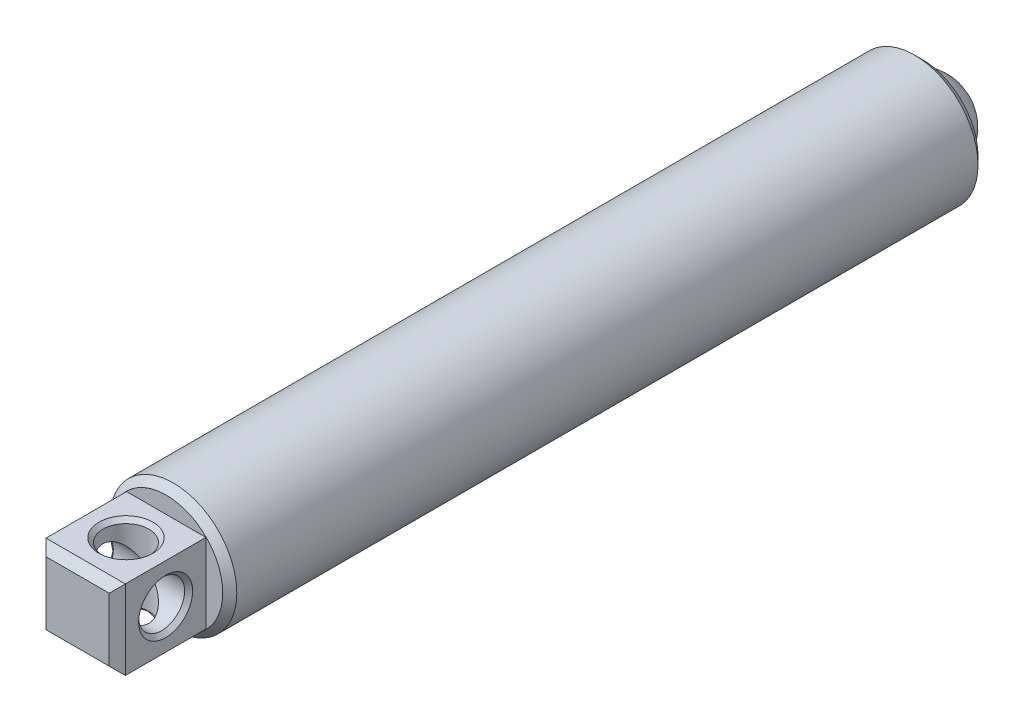
ISO-10303-21;
HEADER;
FILE_DESCRIPTION(('STEP AP214'),'2;1');
FILE_NAME('part.step','',(''),(''),'','','');
FILE_SCHEMA(('AUTOMOTIVE_DESIGN { 1 0 10303 214 1 1 1 1 }'));
ENDSEC;
DATA;
#1=APPLICATION_CONTEXT('core data for automotive mechanical design processes');
#2=APPLICATION_PROTOCOL_DEFINITION('international standard','automotive_design',2000,#1);
#3=PRODUCT_CONTEXT('',#1,'mechanical');
#4=PRODUCT('Part','Part','',(#3));
#5=PRODUCT_RELATED_PRODUCT_CATEGORY('part','',(#4));
#6=PRODUCT_DEFINITION_FORMATION('','',#4);
#7=PRODUCT_DEFINITION_CONTEXT('part definition',#1,'design');
#8=PRODUCT_DEFINITION('design','',#6,#7);
#9=PRODUCT_DEFINITION_SHAPE('','',#8);
#10=(LENGTH_UNIT() NAMED_UNIT(*) SI_UNIT(.MILLI.,.METRE.));
#11=(NAMED_UNIT(*) PLANE_ANGLE_UNIT() SI_UNIT($,.RADIAN.));
#12=(NAMED_UNIT(*) SI_UNIT($,.STERADIAN.) SOLID_ANGLE_UNIT());
#13=UNCERTAINTY_MEASURE_WITH_UNIT(LENGTH_MEASURE(1.E-05),#10,'distance_accuracy_value','');
#14=(GEOMETRIC_REPRESENTATION_CONTEXT(3) GLOBAL_UNCERTAINTY_ASSIGNED_CONTEXT((#13)) GLOBAL_UNIT_ASSIGNED_CONTEXT((#10,
#11,#12)) REPRESENTATION_CONTEXT('',''));
#15=CARTESIAN_POINT('',(0.,0.,0.));
#16=DIRECTION('',(0.,0.,1.));
#17=DIRECTION('',(1.,0.,0.));
#18=AXIS2_PLACEMENT_3D('',#15,#16,#17);
#19=CARTESIAN_POINT('',(-0.337483037474602,-2.46036743646982,8.6550518928985));
#20=DIRECTION('',(1.,0.,0.));
#21=DIRECTION('',(0.,0.,-1.));
#22=AXIS2_PLACEMENT_3D('',#19,#20,#21);
#23=CYLINDRICAL_SURFACE('',#22,0.7239);
#24=CARTESIAN_POINT('',(2.7855129625254,-2.46036743646982,8.6550518928985));
#25=DIRECTION('',(-1.,0.,0.));
#26=DIRECTION('',(0.,0.,1.));
#27=AXIS2_PLACEMENT_3D('',#24,#25,#26);
#28=CIRCLE('',#27,0.7239);
#29=CARTESIAN_POINT('',(2.7855129625254,-2.46036743646982,9.3789518928985));
#30=VERTEX_POINT('',#29);
#31=EDGE_CURVE('P0_E120',#30,#30,#28,.F.);
#32=ORIENTED_EDGE('',*,*,#31,.T.);
#33=EDGE_LOOP('',(#32));
#34=FACE_BOUND('',#33,.T.);
#35=CARTESIAN_POINT('',(1.6625129625254,-2.46036743646982,8.6550518928985));
#36=DIRECTION('',(0.707106781186547,-0.707106781186547,0.));
#37=DIRECTION('',(0.707106781186547,0.707106781186547,0.));
#38=AXIS2_PLACEMENT_3D('',#35,#36,#37);
#39=ELLIPSE('',#38,1.02374919780188,0.7239);
#40=CARTESIAN_POINT('',(1.6625129625254,-2.46036743646982,9.3789518928985));
#41=VERTEX_POINT('',#40);
#42=CARTESIAN_POINT('',(1.6625129625254,-2.46036743646982,7.9311518928985));
#43=VERTEX_POINT('',#42);
#44=EDGE_CURVE('P0_E87',#41,#43,#39,.F.);
#45=ORIENTED_EDGE('',*,*,#44,.T.);
#46=CARTESIAN_POINT('',(1.6625129625254,-2.46036743646982,8.6550518928985));
#47=DIRECTION('',(0.707106781186547,0.707106781186547,0.));
#48=DIRECTION('',(0.707106781186547,-0.707106781186547,0.));
#49=AXIS2_PLACEMENT_3D('',#46,#47,#48);
#50=ELLIPSE('',#49,1.02374919780188,0.7239);
#51=EDGE_CURVE('P0_E83',#43,#41,#50,.F.);
#52=ORIENTED_EDGE('',*,*,#51,.T.);
#53=EDGE_LOOP('',(#45,#52));
#54=FACE_BOUND('',#53,.T.);
#55=ADVANCED_FACE('P0_F16',(#34,#54),#23,.F.);
#56=CARTESIAN_POINT('',(1.6625129625254,-0.682367436469824,7.3850518928985));
#57=DIRECTION('',(0.,0.,-1.));
#58=DIRECTION('',(-1.,0.,0.));
#59=AXIS2_PLACEMENT_3D('',#56,#57,#58);
#60=PLANE('',#59);
#61=CARTESIAN_POINT('',(1.6625129625254,-2.46036743646982,7.3850518928985));
#62=DIRECTION('',(0.,0.,1.));
#63=DIRECTION('',(1.,0.,0.));
#64=AXIS2_PLACEMENT_3D('',#61,#62,#63);
#65=CIRCLE('',#64,1.778);
#66=CARTESIAN_POINT('',(3.4405129625254,-2.46036743646982,7.3850518928985));
#67=VERTEX_POINT('',#66);
#68=EDGE_CURVE('P0_E179',#67,#67,#65,.T.);
#69=ORIENTED_EDGE('',*,*,#68,.T.);
#70=EDGE_LOOP('',(#69));
#71=FACE_BOUND('',#70,.T.);
#72=DIRECTION('',(0.,1.,0.));
#73=VECTOR('',#72,1.);
#74=CARTESIAN_POINT('',(2.9125129625254,-3.71036743646982,7.3850518928985));
#75=LINE('',#74,#73);
#76=CARTESIAN_POINT('',(2.9125129625254,-3.71036743646982,7.3850518928985));
#77=VERTEX_POINT('',#76);
#78=CARTESIAN_POINT('',(2.9125129625254,-1.21036743646982,7.3850518928985));
#79=VERTEX_POINT('',#78);
#80=EDGE_CURVE('P0_E153',#77,#79,#75,.T.);
#81=ORIENTED_EDGE('',*,*,#80,.F.);
#82=DIRECTION('',(1.,0.,0.));
#83=VECTOR('',#82,1.);
#84=CARTESIAN_POINT('',(0.412512962525397,-3.71036743646982,7.3850518928985));
#85=LINE('',#84,#83);
#86=CARTESIAN_POINT('',(0.412512962525397,-3.71036743646982,7.3850518928985));
#87=VERTEX_POINT('',#86);
#88=EDGE_CURVE('P0_E168',#87,#77,#85,.T.);
#89=ORIENTED_EDGE('',*,*,#88,.F.);
#90=DIRECTION('',(0.,-1.,0.));
#91=VECTOR('',#90,1.);
#92=CARTESIAN_POINT('',(0.412512962525397,-3.71036743646982,7.3850518928985));
#93=LINE('',#92,#91);
#94=CARTESIAN_POINT('',(0.412512962525397,-1.21036743646982,7.3850518928985));
#95=VERTEX_POINT('',#94);
#96=EDGE_CURVE('P0_E163',#95,#87,#93,.T.);
#97=ORIENTED_EDGE('',*,*,#96,.F.);
#98=DIRECTION('',(-1.,0.,0.));
#99=VECTOR('',#98,1.);
#100=CARTESIAN_POINT('',(0.412512962525397,-1.21036743646982,7.3850518928985));
#101=LINE('',#100,#99);
#102=EDGE_CURVE('P0_E158',#79,#95,#101,.T.);
#103=ORIENTED_EDGE('',*,*,#102,.F.);
#104=EDGE_LOOP('',(#81,#89,#97,#103));
#105=FACE_BOUND('',#104,.T.);
#106=ADVANCED_FACE('P0_F196',(#71,#105),#60,.F.);
#107=CARTESIAN_POINT('',(1.6625129625254,-2.46036743646982,-14.2614545806176));
#108=DIRECTION('',(0.,0.,-1.));
#109=DIRECTION('',(-1.,0.,0.));
#110=AXIS2_PLACEMENT_3D('',#107,#108,#109);
#111=CONICAL_SURFACE('',#110,0.,0.785398163397443);
#112=CARTESIAN_POINT('',(1.6625129625254,-2.46036743646982,-15.6584545806176));
#113=DIRECTION('',(0.,0.,1.));
#114=DIRECTION('',(1.,0.,0.));
#115=AXIS2_PLACEMENT_3D('',#112,#113,#114);
#116=CIRCLE('',#115,1.397);
#117=CARTESIAN_POINT('',(3.0595129625254,-2.46036743646982,-15.6584545806176));
#118=VERTEX_POINT('',#117);
#119=EDGE_CURVE('P0_E93',#118,#118,#116,.T.);
#120=ORIENTED_EDGE('',*,*,#119,.F.);
#121=EDGE_LOOP('',(#120));
#122=FACE_BOUND('',#121,.T.);
#123=CARTESIAN_POINT('',(1.6625129625254,-2.46036743646982,-14.2614545806176));
#124=VERTEX_POINT('',#123);
#125=VERTEX_LOOP('',#124);
#126=FACE_BOUND('',#125,.T.);
#127=ADVANCED_FACE('P0_F193',(#122,#126),#111,.F.);
#128=CARTESIAN_POINT('',(1.6625129625254,-2.46036743646982,7.3850518928985));
#129=DIRECTION('',(0.,0.,1.));
#130=DIRECTION('',(1.,0.,0.));
#131=AXIS2_PLACEMENT_3D('',#128,#129,#130);
#132=CYLINDRICAL_SURFACE('',#131,1.397);
#133=CARTESIAN_POINT('',(1.6625129625254,-2.46036743646982,-16.4465481071015));
#134=DIRECTION('',(0.,0.,1.));
#135=DIRECTION('',(1.,0.,0.));
#136=AXIS2_PLACEMENT_3D('',#133,#134,#135);
#137=CIRCLE('',#136,1.397);
#138=CARTESIAN_POINT('',(3.0595129625254,-2.46036743646982,-16.4465481071015));
#139=VERTEX_POINT('',#138);
#140=EDGE_CURVE('P0_E185',#139,#139,#137,.T.);
#141=ORIENTED_EDGE('',*,*,#140,.F.);
#142=EDGE_LOOP('',(#141));
#143=FACE_BOUND('',#142,.T.);
#144=ORIENTED_EDGE('',*,*,#119,.T.);
#145=EDGE_LOOP('',(#144));
#146=FACE_BOUND('',#145,.T.);
#147=ADVANCED_FACE('P0_F191',(#143,#146),#132,.F.);
#148=CARTESIAN_POINT('',(1.6625129625254,-0.460371436469824,-16.4465481071015));
#149=DIRECTION('',(0.,0.,1.));
#150=DIRECTION('',(1.,0.,0.));
#151=AXIS2_PLACEMENT_3D('',#148,#149,#150);
#152=PLANE('',#151);
#153=CARTESIAN_POINT('',(1.6625129625254,-2.46036743646982,-16.4465481071015));
#154=DIRECTION('',(0.,0.,1.));
#155=DIRECTION('',(1.,0.,0.));
#156=AXIS2_PLACEMENT_3D('',#153,#154,#155);
#157=CIRCLE('',#156,1.745996);
#158=CARTESIAN_POINT('',(3.4085089625254,-2.46036743646982,-16.4465481071015));
#159=VERTEX_POINT('',#158);
#160=EDGE_CURVE('P0_E102',#159,#159,#157,.F.);
#161=ORIENTED_EDGE('',*,*,#160,.T.);
#162=EDGE_LOOP('',(#161));
#163=FACE_BOUND('',#162,.T.);
#164=ORIENTED_EDGE('',*,*,#140,.T.);
#165=EDGE_LOOP('',(#164));
#166=FACE_BOUND('',#165,.T.);
#167=ADVANCED_FACE('P0_F203',(#163,#166),#152,.F.);
#168=CARTESIAN_POINT('',(1.6625129625254,-2.46036743646982,7.3850518928985));
#169=DIRECTION('',(0.,0.,1.));
#170=DIRECTION('',(1.,0.,0.));
#171=AXIS2_PLACEMENT_3D('',#168,#169,#170);
#172=CYLINDRICAL_SURFACE('',#171,1.999996);
#173=CARTESIAN_POINT('',(1.6625129625254,-2.46036743646982,-16.1925481071015));
#174=DIRECTION('',(0.,0.,1.));
#175=DIRECTION('',(1.,0.,0.));
#176=AXIS2_PLACEMENT_3D('',#173,#174,#175);
#177=CIRCLE('',#176,1.999996);
#178=CARTESIAN_POINT('',(3.6625089625254,-2.46036743646982,-16.1925481071015));
#179=VERTEX_POINT('',#178);
#180=EDGE_CURVE('P0_E95',#179,#179,#177,.T.);
#181=ORIENTED_EDGE('',*,*,#180,.T.);
#182=EDGE_LOOP('',(#181));
#183=FACE_BOUND('',#182,.T.);
#184=CARTESIAN_POINT('',(1.6625129625254,-2.46036743646982,7.1630558928985));
#185=DIRECTION('',(0.,0.,1.));
#186=DIRECTION('',(1.,0.,0.));
#187=AXIS2_PLACEMENT_3D('',#184,#185,#186);
#188=CIRCLE('',#187,1.999996);
#189=CARTESIAN_POINT('',(3.6625089625254,-2.46036743646982,7.1630558928985));
#190=VERTEX_POINT('',#189);
#191=EDGE_CURVE('P0_E182',#190,#190,#188,.T.);
#192=ORIENTED_EDGE('',*,*,#191,.F.);
#193=EDGE_LOOP('',(#192));
#194=FACE_BOUND('',#193,.T.);
#195=ADVANCED_FACE('P0_F286',(#183,#194),#172,.T.);
#196=CARTESIAN_POINT('',(1.6625129625254,-2.46036743646982,7.1630558928985));
#197=DIRECTION('',(0.,0.,-1.));
#198=DIRECTION('',(-1.,0.,0.));
#199=AXIS2_PLACEMENT_3D('',#196,#197,#198);
#200=CONICAL_SURFACE('',#199,1.999996,0.78539816339745);
#201=ORIENTED_EDGE('',*,*,#68,.F.);
#202=EDGE_LOOP('',(#201));
#203=FACE_BOUND('',#202,.T.);
#204=ORIENTED_EDGE('',*,*,#191,.T.);
#205=EDGE_LOOP('',(#204));
#206=FACE_BOUND('',#205,.T.);
#207=ADVANCED_FACE('P0_F289',(#203,#206),#200,.T.);
#208=CARTESIAN_POINT('',(2.9125129625254,-3.71036743646982,10.1790518928985));
#209=DIRECTION('',(-1.,0.,0.));
#210=DIRECTION('',(0.,0.,1.));
#211=AXIS2_PLACEMENT_3D('',#208,#209,#210);
#212=PLANE('',#211);
#213=CARTESIAN_POINT('',(2.9125129625254,-2.46036743646982,8.6550518928985));
#214=DIRECTION('',(-1.,0.,0.));
#215=DIRECTION('',(0.,0.,1.));
#216=AXIS2_PLACEMENT_3D('',#213,#214,#215);
#217=CIRCLE('',#216,0.850900000000001);
#218=CARTESIAN_POINT('',(2.9125129625254,-2.46036743646982,9.5059518928985));
#219=VERTEX_POINT('',#218);
#220=EDGE_CURVE('P0_E117',#219,#219,#217,.T.);
#221=ORIENTED_EDGE('',*,*,#220,.T.);
#222=EDGE_LOOP('',(#221));
#223=FACE_BOUND('',#222,.T.);
#224=DIRECTION('',(0.,0.,-1.));
#225=VECTOR('',#224,1.);
#226=CARTESIAN_POINT('',(2.9125129625254,-1.21036743646982,10.1790518928985));
#227=LINE('',#226,#225);
#228=CARTESIAN_POINT('',(2.9125129625254,-1.21036743646982,9.9250518928985));
#229=VERTEX_POINT('',#228);
#230=EDGE_CURVE('P0_E177',#229,#79,#227,.T.);
#231=ORIENTED_EDGE('',*,*,#230,.F.);
#232=DIRECTION('',(0.,-1.,0.));
#233=VECTOR('',#232,1.);
#234=CARTESIAN_POINT('',(2.9125129625254,-3.71036743646982,9.9250518928985));
#235=LINE('',#234,#233);
#236=CARTESIAN_POINT('',(2.9125129625254,-3.71036743646982,9.9250518928985));
#237=VERTEX_POINT('',#236);
#238=EDGE_CURVE('P0_E11',#229,#237,#235,.T.);
#239=ORIENTED_EDGE('',*,*,#238,.T.);
#240=DIRECTION('',(0.,0.,-1.));
#241=VECTOR('',#240,1.);
#242=CARTESIAN_POINT('',(2.9125129625254,-3.71036743646982,10.1790518928985));
#243=LINE('',#242,#241);
#244=EDGE_CURVE('P0_E171',#237,#77,#243,.T.);
#245=ORIENTED_EDGE('',*,*,#244,.T.);
#246=ORIENTED_EDGE('',*,*,#80,.T.);
#247=EDGE_LOOP('',(#231,#239,#245,#246));
#248=FACE_BOUND('',#247,.T.);
#249=ADVANCED_FACE('P0_F246',(#223,#248),#212,.F.);
#250=CARTESIAN_POINT('',(0.412512962525397,-1.21036743646982,10.1790518928985));
#251=DIRECTION('',(0.,-1.,0.));
#252=DIRECTION('',(0.,0.,-1.));
#253=AXIS2_PLACEMENT_3D('',#250,#251,#252);
#254=PLANE('',#253);
#255=CARTESIAN_POINT('',(1.6625129625254,-1.21036743646982,8.6550518928985));
#256=DIRECTION('',(0.,-1.,0.));
#257=DIRECTION('',(0.,0.,-1.));
#258=AXIS2_PLACEMENT_3D('',#255,#256,#257);
#259=CIRCLE('',#258,0.850900000000002);
#260=CARTESIAN_POINT('',(1.6625129625254,-1.21036743646982,7.8041518928985));
#261=VERTEX_POINT('',#260);
#262=EDGE_CURVE('P0_E123',#261,#261,#259,.T.);
#263=ORIENTED_EDGE('',*,*,#262,.T.);
#264=EDGE_LOOP('',(#263));
#265=FACE_BOUND('',#264,.T.);
#266=DIRECTION('',(0.,0.,-1.));
#267=VECTOR('',#266,1.);
#268=CARTESIAN_POINT('',(0.412512962525397,-1.21036743646982,10.1790518928985));
#269=LINE('',#268,#267);
#270=CARTESIAN_POINT('',(0.412512962525397,-1.21036743646982,9.9250518928985));
#271=VERTEX_POINT('',#270);
#272=EDGE_CURVE('P0_E175',#271,#95,#269,.T.);
#273=ORIENTED_EDGE('',*,*,#272,.F.);
#274=DIRECTION('',(1.,0.,0.));
#275=VECTOR('',#274,1.);
#276=CARTESIAN_POINT('',(0.412512962525397,-1.21036743646982,9.9250518928985));
#277=LINE('',#276,#275);
#278=EDGE_CURVE('P0_E25',#271,#229,#277,.T.);
#279=ORIENTED_EDGE('',*,*,#278,.T.);
#280=ORIENTED_EDGE('',*,*,#230,.T.);
#281=ORIENTED_EDGE('',*,*,#102,.T.);
#282=EDGE_LOOP('',(#273,#279,#280,#281));
#283=FACE_BOUND('',#282,.T.);
#284=ADVANCED_FACE('P0_F237',(#265,#283),#254,.F.);
#285=CARTESIAN_POINT('',(0.412512962525397,-3.71036743646982,10.1790518928985));
#286=DIRECTION('',(1.,0.,0.));
#287=DIRECTION('',(0.,0.,-1.));
#288=AXIS2_PLACEMENT_3D('',#285,#286,#287);
#289=PLANE('',#288);
#290=CARTESIAN_POINT('',(0.412512962525397,-2.46036743646982,8.6550518928985));
#291=DIRECTION('',(1.,0.,0.));
#292=DIRECTION('',(0.,0.,-1.));
#293=AXIS2_PLACEMENT_3D('',#290,#291,#292);
#294=CIRCLE('',#293,0.850900000000001);
#295=CARTESIAN_POINT('',(0.412512962525397,-2.46036743646982,7.8041518928985));
#296=VERTEX_POINT('',#295);
#297=EDGE_CURVE('P0_E105',#296,#296,#294,.T.);
#298=ORIENTED_EDGE('',*,*,#297,.T.);
#299=EDGE_LOOP('',(#298));
#300=FACE_BOUND('',#299,.T.);
#301=DIRECTION('',(0.,0.,-1.));
#302=VECTOR('',#301,1.);
#303=CARTESIAN_POINT('',(0.412512962525397,-3.71036743646982,10.1790518928985));
#304=LINE('',#303,#302);
#305=CARTESIAN_POINT('',(0.412512962525397,-3.71036743646982,9.9250518928985));
#306=VERTEX_POINT('',#305);
#307=EDGE_CURVE('P0_E173',#306,#87,#304,.T.);
#308=ORIENTED_EDGE('',*,*,#307,.F.);
#309=DIRECTION('',(0.,1.,0.));
#310=VECTOR('',#309,1.);
#311=CARTESIAN_POINT('',(0.412512962525397,-3.71036743646982,9.9250518928985));
#312=LINE('',#311,#310);
#313=EDGE_CURVE('P0_E40',#306,#271,#312,.T.);
#314=ORIENTED_EDGE('',*,*,#313,.T.);
#315=ORIENTED_EDGE('',*,*,#272,.T.);
#316=ORIENTED_EDGE('',*,*,#96,.T.);
#317=EDGE_LOOP('',(#308,#314,#315,#316));
#318=FACE_BOUND('',#317,.T.);
#319=ADVANCED_FACE('P0_F235',(#300,#318),#289,.F.);
#320=CARTESIAN_POINT('',(0.412512962525397,-3.71036743646982,10.1790518928985));
#321=DIRECTION('',(0.,1.,0.));
#322=DIRECTION('',(0.,0.,1.));
#323=AXIS2_PLACEMENT_3D('',#320,#321,#322);
#324=PLANE('',#323);
#325=CARTESIAN_POINT('',(1.6625129625254,-3.71036743646982,8.6550518928985));
#326=DIRECTION('',(0.,1.,0.));
#327=DIRECTION('',(0.,0.,1.));
#328=AXIS2_PLACEMENT_3D('',#325,#326,#327);
#329=CIRCLE('',#328,0.850900000000001);
#330=CARTESIAN_POINT('',(1.6625129625254,-3.71036743646982,9.5059518928985));
#331=VERTEX_POINT('',#330);
#332=EDGE_CURVE('P0_E111',#331,#331,#329,.T.);
#333=ORIENTED_EDGE('',*,*,#332,.T.);
#334=EDGE_LOOP('',(#333));
#335=FACE_BOUND('',#334,.T.);
#336=ORIENTED_EDGE('',*,*,#244,.F.);
#337=DIRECTION('',(-1.,0.,0.));
#338=VECTOR('',#337,1.);
#339=CARTESIAN_POINT('',(0.412512962525397,-3.71036743646982,9.9250518928985));
#340=LINE('',#339,#338);
#341=EDGE_CURVE('P0_E138',#237,#306,#340,.T.);
#342=ORIENTED_EDGE('',*,*,#341,.T.);
#343=ORIENTED_EDGE('',*,*,#307,.T.);
#344=ORIENTED_EDGE('',*,*,#88,.T.);
#345=EDGE_LOOP('',(#336,#342,#343,#344));
#346=FACE_BOUND('',#345,.T.);
#347=ADVANCED_FACE('P0_F223',(#335,#346),#324,.F.);
#348=CARTESIAN_POINT('',(1.6625129625254,-2.46036743646982,10.1790518928985));
#349=DIRECTION('',(0.,0.,-1.));
#350=DIRECTION('',(-1.,0.,0.));
#351=AXIS2_PLACEMENT_3D('',#348,#349,#350);
#352=PLANE('',#351);
#353=DIRECTION('',(0.,-1.,0.));
#354=VECTOR('',#353,1.);
#355=CARTESIAN_POINT('',(0.666512962525401,-2.46036743646982,10.1790518928985));
#356=LINE('',#355,#354);
#357=CARTESIAN_POINT('',(0.666512962525401,-1.46436743646983,10.1790518928985));
#358=VERTEX_POINT('',#357);
#359=CARTESIAN_POINT('',(0.666512962525401,-3.45636743646982,10.1790518928985));
#360=VERTEX_POINT('',#359);
#361=EDGE_CURVE('P0_E133',#358,#360,#356,.T.);
#362=ORIENTED_EDGE('',*,*,#361,.T.);
#363=DIRECTION('',(1.,0.,0.));
#364=VECTOR('',#363,1.);
#365=CARTESIAN_POINT('',(1.6625129625254,-3.45636743646982,10.1790518928985));
#366=LINE('',#365,#364);
#367=CARTESIAN_POINT('',(2.65851296252539,-3.45636743646982,10.1790518928985));
#368=VERTEX_POINT('',#367);
#369=EDGE_CURVE('P0_E135',#360,#368,#366,.T.);
#370=ORIENTED_EDGE('',*,*,#369,.T.);
#371=DIRECTION('',(0.,1.,0.));
#372=VECTOR('',#371,1.);
#373=CARTESIAN_POINT('',(2.65851296252539,-2.46036743646982,10.1790518928985));
#374=LINE('',#373,#372);
#375=CARTESIAN_POINT('',(2.65851296252539,-1.46436743646983,10.1790518928985));
#376=VERTEX_POINT('',#375);
#377=EDGE_CURVE('P0_E129',#368,#376,#374,.T.);
#378=ORIENTED_EDGE('',*,*,#377,.T.);
#379=DIRECTION('',(-1.,0.,0.));
#380=VECTOR('',#379,1.);
#381=CARTESIAN_POINT('',(1.6625129625254,-1.46436743646983,10.1790518928985));
#382=LINE('',#381,#380);
#383=EDGE_CURVE('P0_E131',#376,#358,#382,.T.);
#384=ORIENTED_EDGE('',*,*,#383,.T.);
#385=EDGE_LOOP('',(#362,#370,#378,#384));
#386=FACE_BOUND('',#385,.T.);
#387=ADVANCED_FACE('P0_F216',(#386),#352,.F.);
#388=CARTESIAN_POINT('',(0.539512962525396,-2.46036743646982,8.6550518928985));
#389=DIRECTION('',(1.,0.,0.));
#390=DIRECTION('',(0.,0.,-1.));
#391=AXIS2_PLACEMENT_3D('',#388,#389,#390);
#392=CIRCLE('',#391,0.7239);
#393=CARTESIAN_POINT('',(0.539512962525396,-2.46036743646982,7.9311518928985));
#394=VERTEX_POINT('',#393);
#395=EDGE_CURVE('P0_E108',#394,#394,#392,.F.);
#396=ORIENTED_EDGE('',*,*,#395,.T.);
#397=EDGE_LOOP('',(#396));
#398=FACE_BOUND('',#397,.T.);
#399=CARTESIAN_POINT('',(1.6625129625254,-2.46036743646982,8.6550518928985));
#400=DIRECTION('',(0.707106781186547,-0.707106781186547,0.));
#401=DIRECTION('',(0.707106781186547,0.707106781186547,0.));
#402=AXIS2_PLACEMENT_3D('',#399,#400,#401);
#403=ELLIPSE('',#402,1.02374919780188,0.7239);
#404=EDGE_CURVE('P0_E79',#41,#43,#403,.T.);
#405=ORIENTED_EDGE('',*,*,#404,.T.);
#406=CARTESIAN_POINT('',(1.6625129625254,-2.46036743646982,8.6550518928985));
#407=DIRECTION('',(0.707106781186547,0.707106781186547,0.));
#408=DIRECTION('',(0.707106781186547,-0.707106781186547,0.));
#409=AXIS2_PLACEMENT_3D('',#406,#407,#408);
#410=ELLIPSE('',#409,1.02374919780188,0.7239);
#411=EDGE_CURVE('P0_E86',#43,#41,#410,.T.);
#412=ORIENTED_EDGE('',*,*,#411,.T.);
#413=EDGE_LOOP('',(#405,#412));
#414=FACE_BOUND('',#413,.T.);
#415=ADVANCED_FACE('P0_F97',(#398,#414),#23,.F.);
#416=CARTESIAN_POINT('',(1.6625129625254,-4.46036343646982,8.6550518928985));
#417=DIRECTION('',(0.,1.,0.));
#418=DIRECTION('',(0.,0.,1.));
#419=AXIS2_PLACEMENT_3D('',#416,#417,#418);
#420=CYLINDRICAL_SURFACE('',#419,0.7239);
#421=CARTESIAN_POINT('',(1.6625129625254,-1.33736743646982,8.6550518928985));
#422=DIRECTION('',(0.,-1.,0.));
#423=DIRECTION('',(0.,0.,-1.));
#424=AXIS2_PLACEMENT_3D('',#421,#422,#423);
#425=CIRCLE('',#424,0.7239);
#426=CARTESIAN_POINT('',(1.6625129625254,-1.33736743646982,7.9311518928985));
#427=VERTEX_POINT('',#426);
#428=EDGE_CURVE('P0_E126',#427,#427,#425,.F.);
#429=ORIENTED_EDGE('',*,*,#428,.T.);
#430=EDGE_LOOP('',(#429));
#431=FACE_BOUND('',#430,.T.);
#432=ORIENTED_EDGE('',*,*,#44,.F.);
#433=ORIENTED_EDGE('',*,*,#411,.F.);
#434=EDGE_LOOP('',(#432,#433));
#435=FACE_BOUND('',#434,.T.);
#436=ADVANCED_FACE('P0_F91',(#431,#435),#420,.F.);
#437=CARTESIAN_POINT('',(1.6625129625254,-3.58336743646982,8.6550518928985));
#438=DIRECTION('',(0.,1.,0.));
#439=DIRECTION('',(0.,0.,1.));
#440=AXIS2_PLACEMENT_3D('',#437,#438,#439);
#441=CIRCLE('',#440,0.7239);
#442=CARTESIAN_POINT('',(1.6625129625254,-3.58336743646982,9.3789518928985));
#443=VERTEX_POINT('',#442);
#444=EDGE_CURVE('P0_E114',#443,#443,#441,.F.);
#445=ORIENTED_EDGE('',*,*,#444,.T.);
#446=EDGE_LOOP('',(#445));
#447=FACE_BOUND('',#446,.T.);
#448=ORIENTED_EDGE('',*,*,#404,.F.);
#449=ORIENTED_EDGE('',*,*,#51,.F.);
#450=EDGE_LOOP('',(#448,#449));
#451=FACE_BOUND('',#450,.T.);
#452=ADVANCED_FACE('P0_F81',(#447,#451),#420,.F.);
#453=CARTESIAN_POINT('',(1.6625129625254,-2.46036743646982,-16.1925481071015));
#454=DIRECTION('',(0.,0.,1.));
#455=DIRECTION('',(1.,0.,0.));
#456=AXIS2_PLACEMENT_3D('',#453,#454,#455);
#457=CONICAL_SURFACE('',#456,1.999996,0.785398163397441);
#458=ORIENTED_EDGE('',*,*,#160,.F.);
#459=EDGE_LOOP('',(#458));
#460=FACE_BOUND('',#459,.T.);
#461=ORIENTED_EDGE('',*,*,#180,.F.);
#462=EDGE_LOOP('',(#461));
#463=FACE_BOUND('',#462,.T.);
#464=ADVANCED_FACE('P0_F231',(#460,#463),#457,.T.);
#465=CARTESIAN_POINT('',(0.412512962525397,-2.46036743646982,8.6550518928985));
#466=DIRECTION('',(-1.,0.,0.));
#467=DIRECTION('',(0.,0.,1.));
#468=AXIS2_PLACEMENT_3D('',#465,#466,#467);
#469=CONICAL_SURFACE('',#468,0.850900000000001,0.785398163397457);
#470=ORIENTED_EDGE('',*,*,#395,.F.);
#471=EDGE_LOOP('',(#470));
#472=FACE_BOUND('',#471,.T.);
#473=ORIENTED_EDGE('',*,*,#297,.F.);
#474=EDGE_LOOP('',(#473));
#475=FACE_BOUND('',#474,.T.);
#476=ADVANCED_FACE('P0_F227',(#472,#475),#469,.F.);
#477=CARTESIAN_POINT('',(1.6625129625254,-3.71036743646982,8.6550518928985));
#478=DIRECTION('',(0.,-1.,0.));
#479=DIRECTION('',(0.,0.,-1.));
#480=AXIS2_PLACEMENT_3D('',#477,#478,#479);
#481=CONICAL_SURFACE('',#480,0.850900000000002,0.785398163397458);
#482=ORIENTED_EDGE('',*,*,#444,.F.);
#483=EDGE_LOOP('',(#482));
#484=FACE_BOUND('',#483,.T.);
#485=ORIENTED_EDGE('',*,*,#332,.F.);
#486=EDGE_LOOP('',(#485));
#487=FACE_BOUND('',#486,.T.);
#488=ADVANCED_FACE('P0_F230',(#484,#487),#481,.F.);
#489=CARTESIAN_POINT('',(2.9125129625254,-2.46036743646982,8.6550518928985));
#490=DIRECTION('',(1.,0.,0.));
#491=DIRECTION('',(0.,0.,-1.));
#492=AXIS2_PLACEMENT_3D('',#489,#490,#491);
#493=CONICAL_SURFACE('',#492,0.850900000000002,0.785398163397457);
#494=ORIENTED_EDGE('',*,*,#31,.F.);
#495=EDGE_LOOP('',(#494));
#496=FACE_BOUND('',#495,.T.);
#497=ORIENTED_EDGE('',*,*,#220,.F.);
#498=EDGE_LOOP('',(#497));
#499=FACE_BOUND('',#498,.T.);
#500=ADVANCED_FACE('P0_F268',(#496,#499),#493,.F.);
#501=CARTESIAN_POINT('',(1.6625129625254,-1.21036743646982,8.6550518928985));
#502=DIRECTION('',(0.,1.,0.));
#503=DIRECTION('',(0.,0.,1.));
#504=AXIS2_PLACEMENT_3D('',#501,#502,#503);
#505=CONICAL_SURFACE('',#504,0.850900000000001,0.785398163397458);
#506=ORIENTED_EDGE('',*,*,#428,.F.);
#507=EDGE_LOOP('',(#506));
#508=FACE_BOUND('',#507,.T.);
#509=ORIENTED_EDGE('',*,*,#262,.F.);
#510=EDGE_LOOP('',(#509));
#511=FACE_BOUND('',#510,.T.);
#512=ADVANCED_FACE('P0_F262',(#508,#511),#505,.F.);
#513=CARTESIAN_POINT('',(1.6625129625254,-1.46436743646983,10.1790518928985));
#514=DIRECTION('',(0.,-0.707106781186547,-0.707106781186547));
#515=DIRECTION('',(-1.,0.,0.));
#516=AXIS2_PLACEMENT_3D('',#513,#514,#515);
#517=PLANE('',#516);
#518=DIRECTION('',(-0.577350269189626,-0.577350269189626,0.577350269189626));
#519=VECTOR('',#518,1.);
#520=CARTESIAN_POINT('',(2.32651296252539,-1.79636743646983,10.5110518928985));
#521=LINE('',#520,#519);
#522=EDGE_CURVE('P0_E146',#229,#376,#521,.T.);
#523=ORIENTED_EDGE('',*,*,#522,.F.);
#524=ORIENTED_EDGE('',*,*,#278,.F.);
#525=DIRECTION('',(0.577350269189626,-0.577350269189626,0.577350269189626));
#526=VECTOR('',#525,1.);
#527=CARTESIAN_POINT('',(0.9985129625254,-1.79636743646983,10.5110518928985));
#528=LINE('',#527,#526);
#529=EDGE_CURVE('P0_E20',#358,#271,#528,.F.);
#530=ORIENTED_EDGE('',*,*,#529,.F.);
#531=ORIENTED_EDGE('',*,*,#383,.F.);
#532=EDGE_LOOP('',(#523,#524,#530,#531));
#533=FACE_BOUND('',#532,.T.);
#534=ADVANCED_FACE('P0_F18',(#533),#517,.F.);
#535=CARTESIAN_POINT('',(0.666512962525401,-2.46036743646982,10.1790518928985));
#536=DIRECTION('',(0.707106781186547,0.,-0.707106781186547));
#537=DIRECTION('',(0.,-1.,0.));
#538=AXIS2_PLACEMENT_3D('',#535,#536,#537);
#539=PLANE('',#538);
#540=ORIENTED_EDGE('',*,*,#529,.T.);
#541=ORIENTED_EDGE('',*,*,#313,.F.);
#542=DIRECTION('',(0.577350269189626,0.577350269189626,0.577350269189626));
#543=VECTOR('',#542,1.);
#544=CARTESIAN_POINT('',(0.9985129625254,-3.12436743646982,10.5110518928985));
#545=LINE('',#544,#543);
#546=EDGE_CURVE('P0_E145',#360,#306,#545,.F.);
#547=ORIENTED_EDGE('',*,*,#546,.F.);
#548=ORIENTED_EDGE('',*,*,#361,.F.);
#549=EDGE_LOOP('',(#540,#541,#547,#548));
#550=FACE_BOUND('',#549,.T.);
#551=ADVANCED_FACE('P0_F255',(#550),#539,.F.);
#552=CARTESIAN_POINT('',(2.65851296252539,-2.46036743646982,10.1790518928985));
#553=DIRECTION('',(-0.707106781186547,0.,-0.707106781186547));
#554=DIRECTION('',(0.,1.,0.));
#555=AXIS2_PLACEMENT_3D('',#552,#553,#554);
#556=PLANE('',#555);
#557=ORIENTED_EDGE('',*,*,#522,.T.);
#558=ORIENTED_EDGE('',*,*,#377,.F.);
#559=DIRECTION('',(0.577350269189626,-0.577350269189626,-0.577350269189626));
#560=VECTOR('',#559,1.);
#561=CARTESIAN_POINT('',(2.32651296252539,-3.12436743646982,10.5110518928985));
#562=LINE('',#561,#560);
#563=EDGE_CURVE('P0_E143',#237,#368,#562,.F.);
#564=ORIENTED_EDGE('',*,*,#563,.F.);
#565=ORIENTED_EDGE('',*,*,#238,.F.);
#566=EDGE_LOOP('',(#557,#558,#564,#565));
#567=FACE_BOUND('',#566,.T.);
#568=ADVANCED_FACE('P0_F250',(#567),#556,.F.);
#569=CARTESIAN_POINT('',(1.6625129625254,-3.45636743646982,10.1790518928985));
#570=DIRECTION('',(0.,0.707106781186547,-0.707106781186547));
#571=DIRECTION('',(1.,0.,0.));
#572=AXIS2_PLACEMENT_3D('',#569,#570,#571);
#573=PLANE('',#572);
#574=ORIENTED_EDGE('',*,*,#546,.T.);
#575=ORIENTED_EDGE('',*,*,#341,.F.);
#576=ORIENTED_EDGE('',*,*,#563,.T.);
#577=ORIENTED_EDGE('',*,*,#369,.F.);
#578=EDGE_LOOP('',(#574,#575,#576,#577));
#579=FACE_BOUND('',#578,.T.);
#580=ADVANCED_FACE('P0_F253',(#579),#573,.F.);
#581=CLOSED_SHELL('',(#55,#106,#127,#147,#167,#195,#207,#249,#284,#319,#347,#387,#415,#436,#452,
#464,#476,#488,#500,#512,#534,#551,#568,#580));
#582=MANIFOLD_SOLID_BREP('P0_B1',#581);
#583=CARTESIAN_POINT('',(1.6625129625254,-2.46036743646982,-16.2258856071015));
#584=DIRECTION('',(0.330016592471125,0.943975131395816,0.));
#585=DIRECTION('',(-0.943975131395816,0.330016592471125,0.));
#586=AXIS2_PLACEMENT_3D('',#583,#584,#585);
#587=SPHERICAL_SURFACE('',#586,1.3890625);
#588=CARTESIAN_POINT('',(1.6625129625254,-2.46036743646982,-16.2258856071015));
#589=DIRECTION('',(-0.330016592471126,-0.943975131395815,0.));
#590=DIRECTION('',(0.,0.,-1.));
#591=AXIS2_PLACEMENT_3D('',#588,#589,#590);
#592=CIRCLE('',#591,1.3890625);
#593=CARTESIAN_POINT('',(0.351272506570898,-2.0019537634904,-16.2258856071015));
#594=VERTEX_POINT('',#593);
#595=CARTESIAN_POINT('',(2.9737534184799,-2.91878110944925,-16.2258856071015));
#596=VERTEX_POINT('',#595);
#597=EDGE_CURVE('P1_E37',#594,#596,#592,.T.);
#598=ORIENTED_EDGE('',*,*,#597,.T.);
#599=CARTESIAN_POINT('',(1.6625129625254,-2.46036743646982,-16.2258856071015));
#600=DIRECTION('',(0.,0.,-1.));
#601=DIRECTION('',(-0.943975131395815,0.330016592471126,0.));
#602=AXIS2_PLACEMENT_3D('',#599,#600,#601);
#603=CIRCLE('',#602,1.3890625);
#604=EDGE_CURVE('P1_E10',#596,#594,#603,.T.);
#605=ORIENTED_EDGE('',*,*,#604,.T.);
#606=EDGE_LOOP('',(#598,#605));
#607=FACE_BOUND('',#606,.T.);
#608=ADVANCED_FACE('P1_F15',(#607),#587,.T.);
#609=ORIENTED_EDGE('',*,*,#597,.F.);
#610=CARTESIAN_POINT('',(1.6625129625254,-2.46036743646982,-16.2258856071015));
#611=DIRECTION('',(0.,0.,-1.));
#612=DIRECTION('',(-0.943975131395815,0.330016592471126,0.));
#613=AXIS2_PLACEMENT_3D('',#610,#611,#612);
#614=CIRCLE('',#613,1.3890625);
#615=EDGE_CURVE('P1_E22',#594,#596,#614,.T.);
#616=ORIENTED_EDGE('',*,*,#615,.T.);
#617=EDGE_LOOP('',(#609,#616));
#618=FACE_BOUND('',#617,.T.);
#619=ADVANCED_FACE('P1_F36',(#618),#587,.T.);
#620=ORIENTED_EDGE('',*,*,#604,.F.);
#621=EDGE_CURVE('P1_E33',#596,#594,#592,.T.);
#622=ORIENTED_EDGE('',*,*,#621,.T.);
#623=EDGE_LOOP('',(#620,#622));
#624=FACE_BOUND('',#623,.T.);
#625=ADVANCED_FACE('P1_F31',(#624),#587,.T.);
#626=ORIENTED_EDGE('',*,*,#615,.F.);
#627=ORIENTED_EDGE('',*,*,#621,.F.);
#628=EDGE_LOOP('',(#626,#627));
#629=FACE_BOUND('',#628,.T.);
#630=ADVANCED_FACE('P1_F17',(#629),#587,.T.);
#631=CLOSED_SHELL('',(#608,#619,#625,#630));
#632=MANIFOLD_SOLID_BREP('P1_B1',#631);
#633=ADVANCED_BREP_SHAPE_REPRESENTATION('',(#18,#582,#632),#14);
#634=SHAPE_DEFINITION_REPRESENTATION(#9,#633);
ENDSEC;
END-ISO-10303-21;
